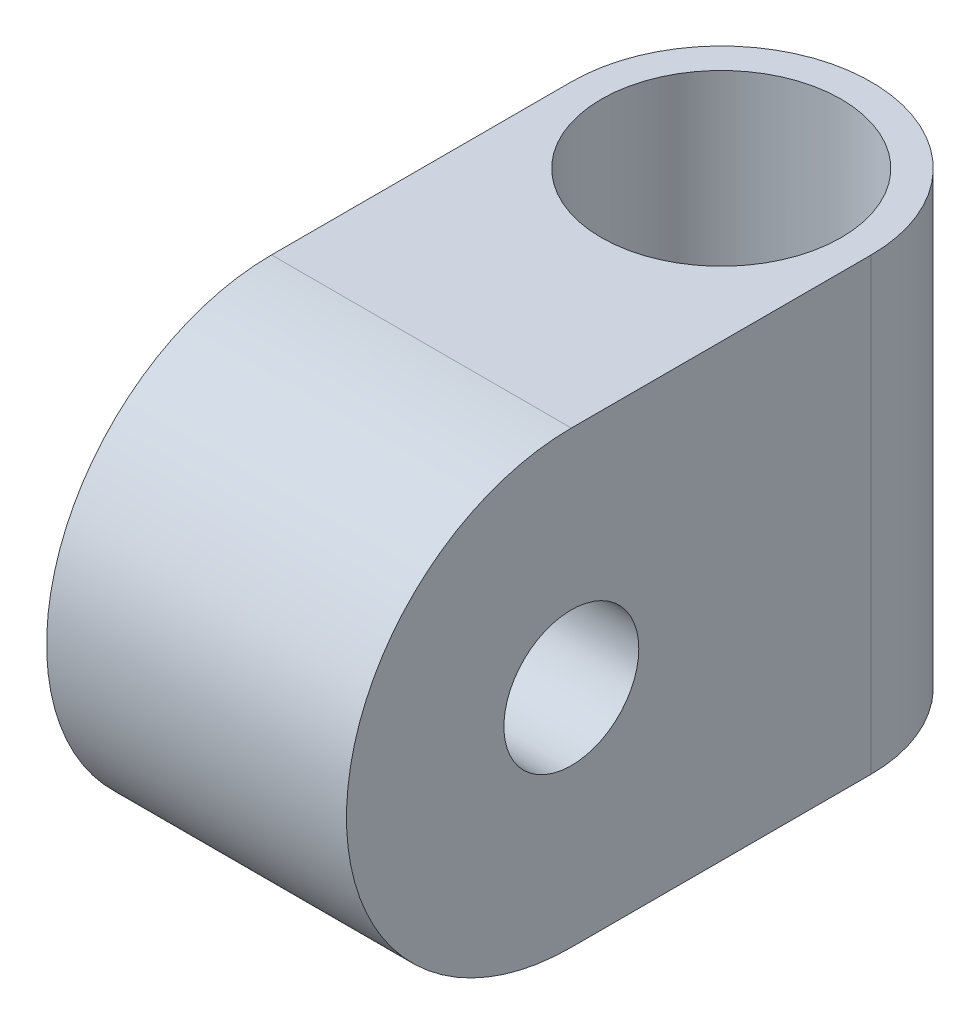
ISO-10303-21;
HEADER;
FILE_DESCRIPTION(('STEP AP214'),'2;1');
FILE_NAME('part.step','',(''),(''),'','','');
FILE_SCHEMA(('AUTOMOTIVE_DESIGN { 1 0 10303 214 1 1 1 1 }'));
ENDSEC;
DATA;
#1=APPLICATION_CONTEXT('core data for automotive mechanical design processes');
#2=APPLICATION_PROTOCOL_DEFINITION('international standard','automotive_design',2000,#1);
#3=PRODUCT_CONTEXT('',#1,'mechanical');
#4=PRODUCT('Part','Part','',(#3));
#5=PRODUCT_RELATED_PRODUCT_CATEGORY('part','',(#4));
#6=PRODUCT_DEFINITION_FORMATION('','',#4);
#7=PRODUCT_DEFINITION_CONTEXT('part definition',#1,'design');
#8=PRODUCT_DEFINITION('design','',#6,#7);
#9=PRODUCT_DEFINITION_SHAPE('','',#8);
#10=(LENGTH_UNIT() NAMED_UNIT(*) SI_UNIT(.MILLI.,.METRE.));
#11=(NAMED_UNIT(*) PLANE_ANGLE_UNIT() SI_UNIT($,.RADIAN.));
#12=(NAMED_UNIT(*) SI_UNIT($,.STERADIAN.) SOLID_ANGLE_UNIT());
#13=UNCERTAINTY_MEASURE_WITH_UNIT(LENGTH_MEASURE(1.E-05),#10,'distance_accuracy_value','');
#14=(GEOMETRIC_REPRESENTATION_CONTEXT(3) GLOBAL_UNCERTAINTY_ASSIGNED_CONTEXT((#13)) GLOBAL_UNIT_ASSIGNED_CONTEXT((#10,
#11,#12)) REPRESENTATION_CONTEXT('',''));
#15=CARTESIAN_POINT('',(0.,0.,0.));
#16=DIRECTION('',(0.,0.,1.));
#17=DIRECTION('',(1.,0.,0.));
#18=AXIS2_PLACEMENT_3D('',#15,#16,#17);
#19=CARTESIAN_POINT('',(5.,-7.5,0.));
#20=DIRECTION('',(0.,-1.,0.));
#21=DIRECTION('',(0.,0.,-1.));
#22=AXIS2_PLACEMENT_3D('',#19,#20,#21);
#23=PLANE('',#22);
#24=CARTESIAN_POINT('',(0.,-7.5,-2.49999999999999));
#25=DIRECTION('',(0.,1.,0.));
#26=DIRECTION('',(0.,0.,1.));
#27=AXIS2_PLACEMENT_3D('',#24,#25,#26);
#28=CIRCLE('',#27,4.);
#29=CARTESIAN_POINT('',(0.,-7.5,1.50000000000001));
#30=VERTEX_POINT('',#29);
#31=EDGE_CURVE('E154',#30,#30,#28,.T.);
#32=ORIENTED_EDGE('',*,*,#31,.T.);
#33=EDGE_LOOP('',(#32));
#34=FACE_BOUND('',#33,.T.);
#35=DIRECTION('',(0.,0.,1.));
#36=VECTOR('',#35,1.);
#37=CARTESIAN_POINT('',(-5.,-7.5,0.));
#38=LINE('',#37,#36);
#39=CARTESIAN_POINT('',(-5.,-7.5,-2.49999999999999));
#40=VERTEX_POINT('',#39);
#41=CARTESIAN_POINT('',(-5.,-7.5,7.5));
#42=VERTEX_POINT('',#41);
#43=EDGE_CURVE('E116',#40,#42,#38,.T.);
#44=ORIENTED_EDGE('',*,*,#43,.F.);
#45=CARTESIAN_POINT('',(0.,-7.5,-2.49999999999999));
#46=DIRECTION('',(0.,1.,0.));
#47=DIRECTION('',(0.,0.,1.));
#48=AXIS2_PLACEMENT_3D('',#45,#46,#47);
#49=CIRCLE('',#48,5.);
#50=CARTESIAN_POINT('',(5.,-7.5,-2.49999999999999));
#51=VERTEX_POINT('',#50);
#52=EDGE_CURVE('E83',#51,#40,#49,.T.);
#53=ORIENTED_EDGE('',*,*,#52,.F.);
#54=DIRECTION('',(0.,0.,1.));
#55=VECTOR('',#54,1.);
#56=CARTESIAN_POINT('',(5.,-7.5,0.));
#57=LINE('',#56,#55);
#58=CARTESIAN_POINT('',(5.,-7.5,7.5));
#59=VERTEX_POINT('',#58);
#60=EDGE_CURVE('E135',#51,#59,#57,.T.);
#61=ORIENTED_EDGE('',*,*,#60,.T.);
#62=DIRECTION('',(-1.,0.,0.));
#63=VECTOR('',#62,1.);
#64=CARTESIAN_POINT('',(5.,-7.5,7.5));
#65=LINE('',#64,#63);
#66=EDGE_CURVE('E12',#59,#42,#65,.T.);
#67=ORIENTED_EDGE('',*,*,#66,.T.);
#68=EDGE_LOOP('',(#44,#53,#61,#67));
#69=FACE_BOUND('',#68,.T.);
#70=ADVANCED_FACE('F66',(#34,#69),#23,.T.);
#71=CARTESIAN_POINT('',(5.,7.5,0.));
#72=DIRECTION('',(0.,-1.,0.));
#73=DIRECTION('',(0.,0.,-1.));
#74=AXIS2_PLACEMENT_3D('',#71,#72,#73);
#75=PLANE('',#74);
#76=CARTESIAN_POINT('',(0.,7.5,-2.49999999999999));
#77=DIRECTION('',(0.,-1.,0.));
#78=DIRECTION('',(0.,0.,-1.));
#79=AXIS2_PLACEMENT_3D('',#76,#77,#78);
#80=CIRCLE('',#79,4.);
#81=CARTESIAN_POINT('',(0.,7.5,-6.49999999999999));
#82=VERTEX_POINT('',#81);
#83=EDGE_CURVE('E70',#82,#82,#80,.T.);
#84=ORIENTED_EDGE('',*,*,#83,.T.);
#85=EDGE_LOOP('',(#84));
#86=FACE_BOUND('',#85,.T.);
#87=DIRECTION('',(0.,0.,1.));
#88=VECTOR('',#87,1.);
#89=CARTESIAN_POINT('',(5.,7.5,0.));
#90=LINE('',#89,#88);
#91=CARTESIAN_POINT('',(5.,7.500006,-2.49999999999999));
#92=VERTEX_POINT('',#91);
#93=CARTESIAN_POINT('',(5.,7.5,7.5));
#94=VERTEX_POINT('',#93);
#95=EDGE_CURVE('E92',#92,#94,#90,.T.);
#96=ORIENTED_EDGE('',*,*,#95,.F.);
#97=CARTESIAN_POINT('',(0.,7.5,-2.49999999999999));
#98=DIRECTION('',(0.,-1.,0.));
#99=DIRECTION('',(0.,0.,-1.));
#100=AXIS2_PLACEMENT_3D('',#97,#98,#99);
#101=CIRCLE('',#100,5.);
#102=CARTESIAN_POINT('',(-5.,7.5,-2.49999999999999));
#103=VERTEX_POINT('',#102);
#104=EDGE_CURVE('E112',#103,#92,#101,.T.);
#105=ORIENTED_EDGE('',*,*,#104,.F.);
#106=DIRECTION('',(0.,0.,1.));
#107=VECTOR('',#106,1.);
#108=CARTESIAN_POINT('',(-5.,7.5,0.));
#109=LINE('',#108,#107);
#110=CARTESIAN_POINT('',(-5.,7.5,7.5));
#111=VERTEX_POINT('',#110);
#112=EDGE_CURVE('E106',#103,#111,#109,.T.);
#113=ORIENTED_EDGE('',*,*,#112,.T.);
#114=DIRECTION('',(-1.,0.,0.));
#115=VECTOR('',#114,1.);
#116=CARTESIAN_POINT('',(5.,7.5,7.5));
#117=LINE('',#116,#115);
#118=EDGE_CURVE('E75',#94,#111,#117,.T.);
#119=ORIENTED_EDGE('',*,*,#118,.F.);
#120=EDGE_LOOP('',(#96,#105,#113,#119));
#121=FACE_BOUND('',#120,.T.);
#122=ADVANCED_FACE('F108',(#86,#121),#75,.F.);
#123=CARTESIAN_POINT('',(5.,0.,0.));
#124=DIRECTION('',(1.,0.,0.));
#125=DIRECTION('',(0.,0.,-1.));
#126=AXIS2_PLACEMENT_3D('',#123,#124,#125);
#127=PLANE('',#126);
#128=CARTESIAN_POINT('',(5.,0.,7.5));
#129=DIRECTION('',(1.,0.,0.));
#130=DIRECTION('',(0.,0.,-1.));
#131=AXIS2_PLACEMENT_3D('',#128,#129,#130);
#132=CIRCLE('',#131,2.25);
#133=CARTESIAN_POINT('',(5.,0.,5.25));
#134=VERTEX_POINT('',#133);
#135=EDGE_CURVE('E115',#134,#134,#132,.T.);
#136=ORIENTED_EDGE('',*,*,#135,.F.);
#137=EDGE_LOOP('',(#136));
#138=FACE_BOUND('',#137,.T.);
#139=ORIENTED_EDGE('',*,*,#60,.F.);
#140=DIRECTION('',(0.,1.,0.));
#141=VECTOR('',#140,1.);
#142=CARTESIAN_POINT('',(5.,-7.5,-2.49999999999999));
#143=LINE('',#142,#141);
#144=EDGE_CURVE('E145',#51,#92,#143,.T.);
#145=ORIENTED_EDGE('',*,*,#144,.T.);
#146=ORIENTED_EDGE('',*,*,#95,.T.);
#147=CARTESIAN_POINT('',(5.,0.,7.5));
#148=DIRECTION('',(1.,0.,0.));
#149=DIRECTION('',(0.,0.,-1.));
#150=AXIS2_PLACEMENT_3D('',#147,#148,#149);
#151=CIRCLE('',#150,7.5);
#152=EDGE_CURVE('E123',#94,#59,#151,.T.);
#153=ORIENTED_EDGE('',*,*,#152,.T.);
#154=EDGE_LOOP('',(#139,#145,#146,#153));
#155=FACE_BOUND('',#154,.T.);
#156=ADVANCED_FACE('F169',(#138,#155),#127,.T.);
#157=CARTESIAN_POINT('',(-5.,0.,0.));
#158=DIRECTION('',(1.,0.,0.));
#159=DIRECTION('',(0.,0.,-1.));
#160=AXIS2_PLACEMENT_3D('',#157,#158,#159);
#161=PLANE('',#160);
#162=CARTESIAN_POINT('',(-5.,0.,7.5));
#163=DIRECTION('',(1.,0.,0.));
#164=DIRECTION('',(0.,0.,-1.));
#165=AXIS2_PLACEMENT_3D('',#162,#163,#164);
#166=CIRCLE('',#165,2.25);
#167=CARTESIAN_POINT('',(-5.,0.,5.25));
#168=VERTEX_POINT('',#167);
#169=EDGE_CURVE('E127',#168,#168,#166,.T.);
#170=ORIENTED_EDGE('',*,*,#169,.T.);
#171=EDGE_LOOP('',(#170));
#172=FACE_BOUND('',#171,.T.);
#173=DIRECTION('',(0.,1.,0.));
#174=VECTOR('',#173,1.);
#175=CARTESIAN_POINT('',(-5.,-7.5,-2.49999999999999));
#176=LINE('',#175,#174);
#177=EDGE_CURVE('E148',#40,#103,#176,.T.);
#178=ORIENTED_EDGE('',*,*,#177,.F.);
#179=ORIENTED_EDGE('',*,*,#43,.T.);
#180=CARTESIAN_POINT('',(-5.,0.,7.5));
#181=DIRECTION('',(1.,0.,0.));
#182=DIRECTION('',(0.,0.,-1.));
#183=AXIS2_PLACEMENT_3D('',#180,#181,#182);
#184=CIRCLE('',#183,7.5);
#185=EDGE_CURVE('E122',#111,#42,#184,.T.);
#186=ORIENTED_EDGE('',*,*,#185,.F.);
#187=ORIENTED_EDGE('',*,*,#112,.F.);
#188=EDGE_LOOP('',(#178,#179,#186,#187));
#189=FACE_BOUND('',#188,.T.);
#190=ADVANCED_FACE('F125',(#172,#189),#161,.F.);
#191=CARTESIAN_POINT('',(5.,0.,7.5));
#192=DIRECTION('',(-1.,0.,0.));
#193=DIRECTION('',(0.,0.,1.));
#194=AXIS2_PLACEMENT_3D('',#191,#192,#193);
#195=CYLINDRICAL_SURFACE('',#194,7.5);
#196=ORIENTED_EDGE('',*,*,#185,.T.);
#197=ORIENTED_EDGE('',*,*,#66,.F.);
#198=ORIENTED_EDGE('',*,*,#152,.F.);
#199=ORIENTED_EDGE('',*,*,#118,.T.);
#200=EDGE_LOOP('',(#196,#197,#198,#199));
#201=FACE_BOUND('',#200,.T.);
#202=ADVANCED_FACE('F120',(#201),#195,.T.);
#203=CARTESIAN_POINT('',(5.,0.,7.5));
#204=DIRECTION('',(-1.,0.,0.));
#205=DIRECTION('',(0.,0.,1.));
#206=AXIS2_PLACEMENT_3D('',#203,#204,#205);
#207=CYLINDRICAL_SURFACE('',#206,2.25);
#208=ORIENTED_EDGE('',*,*,#135,.T.);
#209=EDGE_LOOP('',(#208));
#210=FACE_BOUND('',#209,.T.);
#211=ORIENTED_EDGE('',*,*,#169,.F.);
#212=EDGE_LOOP('',(#211));
#213=FACE_BOUND('',#212,.T.);
#214=ADVANCED_FACE('F68',(#210,#213),#207,.F.);
#215=CARTESIAN_POINT('',(0.,-7.5,-2.49999999999999));
#216=DIRECTION('',(0.,1.,0.));
#217=DIRECTION('',(0.,0.,1.));
#218=AXIS2_PLACEMENT_3D('',#215,#216,#217);
#219=CYLINDRICAL_SURFACE('',#218,5.);
#220=ORIENTED_EDGE('',*,*,#52,.T.);
#221=ORIENTED_EDGE('',*,*,#177,.T.);
#222=ORIENTED_EDGE('',*,*,#104,.T.);
#223=ORIENTED_EDGE('',*,*,#144,.F.);
#224=EDGE_LOOP('',(#220,#221,#222,#223));
#225=FACE_BOUND('',#224,.T.);
#226=ADVANCED_FACE('F163',(#225),#219,.T.);
#227=CARTESIAN_POINT('',(0.,-7.5,-2.49999999999999));
#228=DIRECTION('',(0.,1.,0.));
#229=DIRECTION('',(0.,0.,1.));
#230=AXIS2_PLACEMENT_3D('',#227,#228,#229);
#231=CYLINDRICAL_SURFACE('',#230,4.);
#232=ORIENTED_EDGE('',*,*,#31,.F.);
#233=EDGE_LOOP('',(#232));
#234=FACE_BOUND('',#233,.T.);
#235=ORIENTED_EDGE('',*,*,#83,.F.);
#236=EDGE_LOOP('',(#235));
#237=FACE_BOUND('',#236,.T.);
#238=ADVANCED_FACE('F160',(#234,#237),#231,.F.);
#239=CLOSED_SHELL('',(#70,#122,#156,#190,#202,#214,#226,#238));
#240=MANIFOLD_SOLID_BREP('B2',#239);
#241=ADVANCED_BREP_SHAPE_REPRESENTATION('',(#18,#240),#14);
#242=SHAPE_DEFINITION_REPRESENTATION(#9,#241);
ENDSEC;
END-ISO-10303-21;
